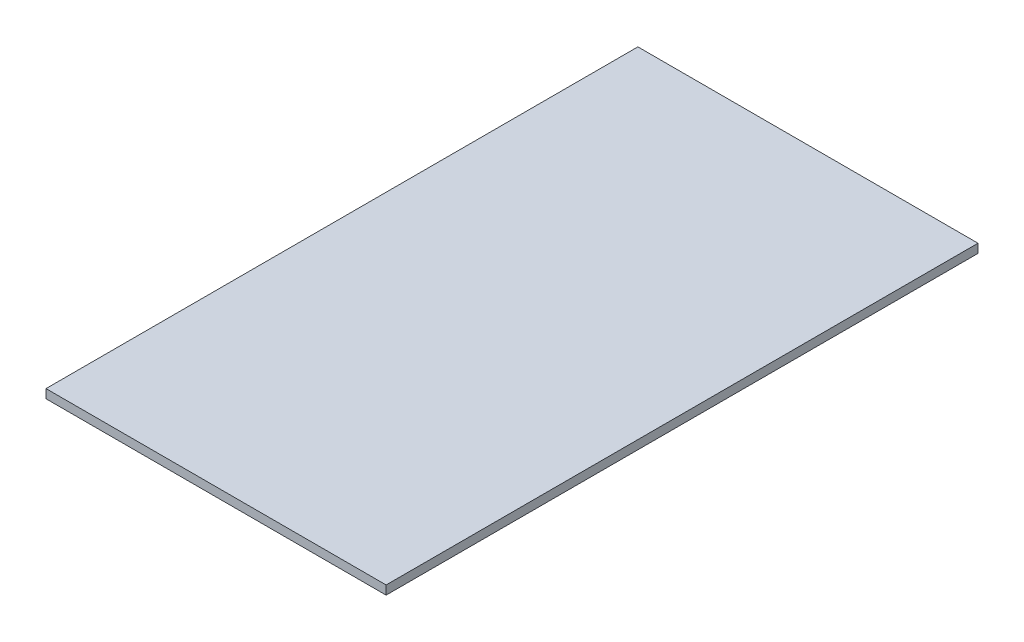
ISO-10303-21;
HEADER;
FILE_DESCRIPTION(('STEP AP214'),'2;1');
FILE_NAME('part.step','',(''),(''),'','','');
FILE_SCHEMA(('AUTOMOTIVE_DESIGN { 1 0 10303 214 1 1 1 1 }'));
ENDSEC;
DATA;
#1=APPLICATION_CONTEXT('core data for automotive mechanical design processes');
#2=APPLICATION_PROTOCOL_DEFINITION('international standard','automotive_design',2000,#1);
#3=PRODUCT_CONTEXT('',#1,'mechanical');
#4=PRODUCT('Part','Part','',(#3));
#5=PRODUCT_RELATED_PRODUCT_CATEGORY('part','',(#4));
#6=PRODUCT_DEFINITION_FORMATION('','',#4);
#7=PRODUCT_DEFINITION_CONTEXT('part definition',#1,'design');
#8=PRODUCT_DEFINITION('design','',#6,#7);
#9=PRODUCT_DEFINITION_SHAPE('','',#8);
#10=(LENGTH_UNIT() NAMED_UNIT(*) SI_UNIT(.MILLI.,.METRE.));
#11=(NAMED_UNIT(*) PLANE_ANGLE_UNIT() SI_UNIT($,.RADIAN.));
#12=(NAMED_UNIT(*) SI_UNIT($,.STERADIAN.) SOLID_ANGLE_UNIT());
#13=UNCERTAINTY_MEASURE_WITH_UNIT(LENGTH_MEASURE(1.E-05),#10,'distance_accuracy_value','');
#14=(GEOMETRIC_REPRESENTATION_CONTEXT(3) GLOBAL_UNCERTAINTY_ASSIGNED_CONTEXT((#13)) GLOBAL_UNIT_ASSIGNED_CONTEXT((#10,
#11,#12)) REPRESENTATION_CONTEXT('',''));
#15=CARTESIAN_POINT('',(0.,0.,0.));
#16=DIRECTION('',(0.,0.,1.));
#17=DIRECTION('',(1.,0.,0.));
#18=AXIS2_PLACEMENT_3D('',#15,#16,#17);
#19=CARTESIAN_POINT('',(-87.9452365810821,10.,-33.8155627980781));
#20=DIRECTION('',(1.,0.,0.));
#21=DIRECTION('',(0.,0.,-1.));
#22=AXIS2_PLACEMENT_3D('',#19,#20,#21);
#23=PLANE('',#22);
#24=DIRECTION('',(0.,0.,1.));
#25=VECTOR('',#24,1.);
#26=CARTESIAN_POINT('',(-87.9452365810821,0.,-33.8155627980781));
#27=LINE('',#26,#25);
#28=CARTESIAN_POINT('',(-87.9452365810821,0.,-33.8155627980781));
#29=VERTEX_POINT('',#28);
#30=CARTESIAN_POINT('',(-87.945236581082,0.,636.184437201922));
#31=VERTEX_POINT('',#30);
#32=EDGE_CURVE('E96',#29,#31,#27,.T.);
#33=ORIENTED_EDGE('',*,*,#32,.T.);
#34=DIRECTION('',(0.,-1.,0.));
#35=VECTOR('',#34,1.);
#36=CARTESIAN_POINT('',(-87.945236581082,10.,636.184437201922));
#37=LINE('',#36,#35);
#38=CARTESIAN_POINT('',(-87.945236581082,10.,636.184437201922));
#39=VERTEX_POINT('',#38);
#40=EDGE_CURVE('E11',#39,#31,#37,.T.);
#41=ORIENTED_EDGE('',*,*,#40,.F.);
#42=DIRECTION('',(0.,0.,1.));
#43=VECTOR('',#42,1.);
#44=CARTESIAN_POINT('',(-87.9452365810821,10.,-33.8155627980781));
#45=LINE('',#44,#43);
#46=CARTESIAN_POINT('',(-87.9452365810821,10.,-33.8155627980781));
#47=VERTEX_POINT('',#46);
#48=EDGE_CURVE('E84',#47,#39,#45,.T.);
#49=ORIENTED_EDGE('',*,*,#48,.F.);
#50=DIRECTION('',(0.,-1.,0.));
#51=VECTOR('',#50,1.);
#52=CARTESIAN_POINT('',(-87.9452365810821,10.,-33.8155627980781));
#53=LINE('',#52,#51);
#54=EDGE_CURVE('E92',#47,#29,#53,.T.);
#55=ORIENTED_EDGE('',*,*,#54,.T.);
#56=EDGE_LOOP('',(#33,#41,#49,#55));
#57=FACE_BOUND('',#56,.T.);
#58=ADVANCED_FACE('F33',(#57),#23,.F.);
#59=CARTESIAN_POINT('',(-87.945236581082,10.,636.184437201922));
#60=DIRECTION('',(0.,0.,-1.));
#61=DIRECTION('',(-1.,0.,0.));
#62=AXIS2_PLACEMENT_3D('',#59,#60,#61);
#63=PLANE('',#62);
#64=DIRECTION('',(1.,0.,0.));
#65=VECTOR('',#64,1.);
#66=CARTESIAN_POINT('',(-87.945236581082,0.,636.184437201922));
#67=LINE('',#66,#65);
#68=CARTESIAN_POINT('',(297.054763418918,0.,636.184437201922));
#69=VERTEX_POINT('',#68);
#70=EDGE_CURVE('E88',#31,#69,#67,.T.);
#71=ORIENTED_EDGE('',*,*,#70,.T.);
#72=DIRECTION('',(0.,-1.,0.));
#73=VECTOR('',#72,1.);
#74=CARTESIAN_POINT('',(297.054763418918,10.,636.184437201922));
#75=LINE('',#74,#73);
#76=CARTESIAN_POINT('',(297.054763418918,10.,636.184437201922));
#77=VERTEX_POINT('',#76);
#78=EDGE_CURVE('E41',#77,#69,#75,.T.);
#79=ORIENTED_EDGE('',*,*,#78,.F.);
#80=DIRECTION('',(1.,0.,0.));
#81=VECTOR('',#80,1.);
#82=CARTESIAN_POINT('',(-87.945236581082,10.,636.184437201922));
#83=LINE('',#82,#81);
#84=EDGE_CURVE('E79',#39,#77,#83,.T.);
#85=ORIENTED_EDGE('',*,*,#84,.F.);
#86=ORIENTED_EDGE('',*,*,#40,.T.);
#87=EDGE_LOOP('',(#71,#79,#85,#86));
#88=FACE_BOUND('',#87,.T.);
#89=ADVANCED_FACE('F87',(#88),#63,.F.);
#90=CARTESIAN_POINT('',(297.054763418918,10.,-33.8155627980781));
#91=DIRECTION('',(-1.,0.,0.));
#92=DIRECTION('',(0.,0.,1.));
#93=AXIS2_PLACEMENT_3D('',#90,#91,#92);
#94=PLANE('',#93);
#95=DIRECTION('',(0.,0.,-1.));
#96=VECTOR('',#95,1.);
#97=CARTESIAN_POINT('',(297.054763418918,0.,-33.8155627980781));
#98=LINE('',#97,#96);
#99=CARTESIAN_POINT('',(297.054763418918,0.,-33.8155627980781));
#100=VERTEX_POINT('',#99);
#101=EDGE_CURVE('E66',#69,#100,#98,.T.);
#102=ORIENTED_EDGE('',*,*,#101,.T.);
#103=DIRECTION('',(0.,-1.,0.));
#104=VECTOR('',#103,1.);
#105=CARTESIAN_POINT('',(297.054763418918,10.,-33.8155627980781));
#106=LINE('',#105,#104);
#107=CARTESIAN_POINT('',(297.054763418918,10.,-33.8155627980781));
#108=VERTEX_POINT('',#107);
#109=EDGE_CURVE('E89',#108,#100,#106,.T.);
#110=ORIENTED_EDGE('',*,*,#109,.F.);
#111=DIRECTION('',(0.,0.,-1.));
#112=VECTOR('',#111,1.);
#113=CARTESIAN_POINT('',(297.054763418918,10.,-33.8155627980781));
#114=LINE('',#113,#112);
#115=EDGE_CURVE('E82',#77,#108,#114,.T.);
#116=ORIENTED_EDGE('',*,*,#115,.F.);
#117=ORIENTED_EDGE('',*,*,#78,.T.);
#118=EDGE_LOOP('',(#102,#110,#116,#117));
#119=FACE_BOUND('',#118,.T.);
#120=ADVANCED_FACE('F90',(#119),#94,.F.);
#121=CARTESIAN_POINT('',(-87.9452365810821,10.,-33.8155627980781));
#122=DIRECTION('',(0.,0.,1.));
#123=DIRECTION('',(1.,0.,0.));
#124=AXIS2_PLACEMENT_3D('',#121,#122,#123);
#125=PLANE('',#124);
#126=DIRECTION('',(-1.,0.,0.));
#127=VECTOR('',#126,1.);
#128=CARTESIAN_POINT('',(-87.9452365810821,0.,-33.8155627980781));
#129=LINE('',#128,#127);
#130=EDGE_CURVE('E72',#100,#29,#129,.T.);
#131=ORIENTED_EDGE('',*,*,#130,.T.);
#132=ORIENTED_EDGE('',*,*,#54,.F.);
#133=DIRECTION('',(-1.,0.,0.));
#134=VECTOR('',#133,1.);
#135=CARTESIAN_POINT('',(-87.9452365810821,10.,-33.8155627980781));
#136=LINE('',#135,#134);
#137=EDGE_CURVE('E49',#108,#47,#136,.T.);
#138=ORIENTED_EDGE('',*,*,#137,.F.);
#139=ORIENTED_EDGE('',*,*,#109,.T.);
#140=EDGE_LOOP('',(#131,#132,#138,#139));
#141=FACE_BOUND('',#140,.T.);
#142=ADVANCED_FACE('F103',(#141),#125,.F.);
#143=CARTESIAN_POINT('',(0.,10.,0.));
#144=DIRECTION('',(0.,1.,0.));
#145=DIRECTION('',(0.,0.,1.));
#146=AXIS2_PLACEMENT_3D('',#143,#144,#145);
#147=PLANE('',#146);
#148=ORIENTED_EDGE('',*,*,#48,.T.);
#149=ORIENTED_EDGE('',*,*,#84,.T.);
#150=ORIENTED_EDGE('',*,*,#115,.T.);
#151=ORIENTED_EDGE('',*,*,#137,.T.);
#152=EDGE_LOOP('',(#148,#149,#150,#151));
#153=FACE_BOUND('',#152,.T.);
#154=ADVANCED_FACE('F80',(#153),#147,.T.);
#155=CARTESIAN_POINT('',(0.,0.,0.));
#156=DIRECTION('',(0.,1.,0.));
#157=DIRECTION('',(0.,0.,1.));
#158=AXIS2_PLACEMENT_3D('',#155,#156,#157);
#159=PLANE('',#158);
#160=ORIENTED_EDGE('',*,*,#32,.F.);
#161=ORIENTED_EDGE('',*,*,#130,.F.);
#162=ORIENTED_EDGE('',*,*,#101,.F.);
#163=ORIENTED_EDGE('',*,*,#70,.F.);
#164=EDGE_LOOP('',(#160,#161,#162,#163));
#165=FACE_BOUND('',#164,.T.);
#166=ADVANCED_FACE('F106',(#165),#159,.F.);
#167=CLOSED_SHELL('',(#58,#89,#120,#142,#154,#166));
#168=MANIFOLD_SOLID_BREP('B2',#167);
#169=ADVANCED_BREP_SHAPE_REPRESENTATION('',(#18,#168),#14);
#170=SHAPE_DEFINITION_REPRESENTATION(#9,#169);
ENDSEC;
END-ISO-10303-21;
